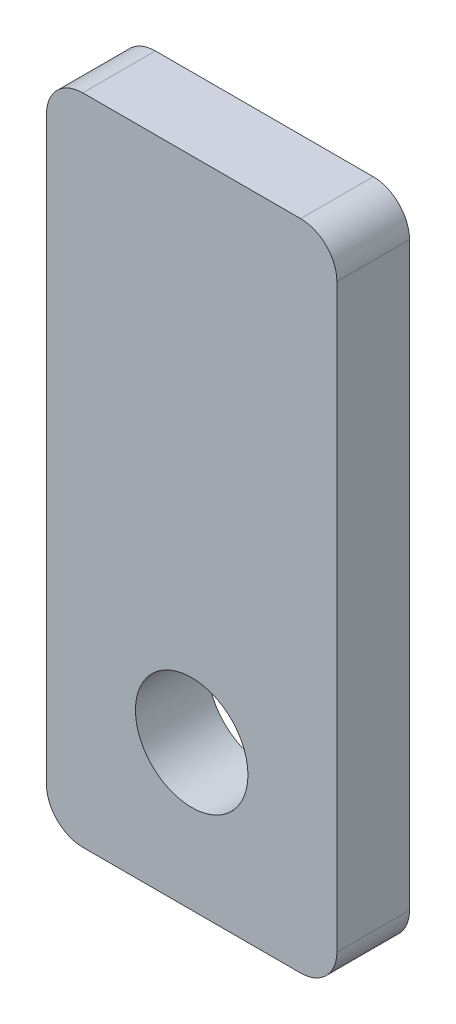
ISO-10303-21;
HEADER;
FILE_DESCRIPTION(('STEP AP214'),'2;1');
FILE_NAME('part.step','',(''),(''),'','','');
FILE_SCHEMA(('AUTOMOTIVE_DESIGN { 1 0 10303 214 1 1 1 1 }'));
ENDSEC;
DATA;
#1=APPLICATION_CONTEXT('core data for automotive mechanical design processes');
#2=APPLICATION_PROTOCOL_DEFINITION('international standard','automotive_design',2000,#1);
#3=PRODUCT_CONTEXT('',#1,'mechanical');
#4=PRODUCT('Part','Part','',(#3));
#5=PRODUCT_RELATED_PRODUCT_CATEGORY('part','',(#4));
#6=PRODUCT_DEFINITION_FORMATION('','',#4);
#7=PRODUCT_DEFINITION_CONTEXT('part definition',#1,'design');
#8=PRODUCT_DEFINITION('design','',#6,#7);
#9=PRODUCT_DEFINITION_SHAPE('','',#8);
#10=(LENGTH_UNIT() NAMED_UNIT(*) SI_UNIT(.MILLI.,.METRE.));
#11=(NAMED_UNIT(*) PLANE_ANGLE_UNIT() SI_UNIT($,.RADIAN.));
#12=(NAMED_UNIT(*) SI_UNIT($,.STERADIAN.) SOLID_ANGLE_UNIT());
#13=UNCERTAINTY_MEASURE_WITH_UNIT(LENGTH_MEASURE(1.E-05),#10,'distance_accuracy_value','');
#14=(GEOMETRIC_REPRESENTATION_CONTEXT(3) GLOBAL_UNCERTAINTY_ASSIGNED_CONTEXT((#13)) GLOBAL_UNIT_ASSIGNED_CONTEXT((#10,
#11,#12)) REPRESENTATION_CONTEXT('',''));
#15=CARTESIAN_POINT('',(0.,0.,0.));
#16=DIRECTION('',(0.,0.,1.));
#17=DIRECTION('',(1.,0.,0.));
#18=AXIS2_PLACEMENT_3D('',#15,#16,#17);
#19=CARTESIAN_POINT('',(-3.,-8.,2.));
#20=DIRECTION('',(0.,0.,1.));
#21=DIRECTION('',(1.,0.,0.));
#22=AXIS2_PLACEMENT_3D('',#19,#20,#21);
#23=PLANE('',#22);
#24=CARTESIAN_POINT('',(-3.,-8.,2.));
#25=DIRECTION('',(0.,0.,1.));
#26=DIRECTION('',(1.,0.,0.));
#27=AXIS2_PLACEMENT_3D('',#24,#25,#26);
#28=CIRCLE('',#27,1.);
#29=CARTESIAN_POINT('',(-4.,-7.99999999999999,2.));
#30=VERTEX_POINT('',#29);
#31=CARTESIAN_POINT('',(-2.99999999999999,-9.,2.));
#32=VERTEX_POINT('',#31);
#33=EDGE_CURVE('E168',#30,#32,#28,.T.);
#34=ORIENTED_EDGE('',*,*,#33,.T.);
#35=DIRECTION('',(1.,0.,0.));
#36=VECTOR('',#35,1.);
#37=CARTESIAN_POINT('',(-2.99999999999999,-9.,2.));
#38=LINE('',#37,#36);
#39=CARTESIAN_POINT('',(3.,-9.,2.));
#40=VERTEX_POINT('',#39);
#41=EDGE_CURVE('E104',#32,#40,#38,.T.);
#42=ORIENTED_EDGE('',*,*,#41,.T.);
#43=CARTESIAN_POINT('',(3.,-8.,2.));
#44=DIRECTION('',(0.,0.,1.));
#45=DIRECTION('',(1.,0.,0.));
#46=AXIS2_PLACEMENT_3D('',#43,#44,#45);
#47=CIRCLE('',#46,1.);
#48=CARTESIAN_POINT('',(4.,-7.99999999999999,2.));
#49=VERTEX_POINT('',#48);
#50=EDGE_CURVE('E189',#40,#49,#47,.T.);
#51=ORIENTED_EDGE('',*,*,#50,.T.);
#52=DIRECTION('',(0.,1.,0.));
#53=VECTOR('',#52,1.);
#54=CARTESIAN_POINT('',(4.,7.99999999999999,2.));
#55=LINE('',#54,#53);
#56=CARTESIAN_POINT('',(4.,7.99999999999999,2.));
#57=VERTEX_POINT('',#56);
#58=EDGE_CURVE('E203',#49,#57,#55,.T.);
#59=ORIENTED_EDGE('',*,*,#58,.T.);
#60=CARTESIAN_POINT('',(3.,8.,2.));
#61=DIRECTION('',(0.,0.,1.));
#62=DIRECTION('',(1.,0.,0.));
#63=AXIS2_PLACEMENT_3D('',#60,#61,#62);
#64=CIRCLE('',#63,1.);
#65=CARTESIAN_POINT('',(2.99999999999999,9.,2.));
#66=VERTEX_POINT('',#65);
#67=EDGE_CURVE('E123',#57,#66,#64,.T.);
#68=ORIENTED_EDGE('',*,*,#67,.T.);
#69=DIRECTION('',(-1.,0.,0.));
#70=VECTOR('',#69,1.);
#71=CARTESIAN_POINT('',(-2.99999999999999,9.,2.));
#72=LINE('',#71,#70);
#73=CARTESIAN_POINT('',(-2.99999999999999,9.,2.));
#74=VERTEX_POINT('',#73);
#75=EDGE_CURVE('E117',#66,#74,#72,.T.);
#76=ORIENTED_EDGE('',*,*,#75,.T.);
#77=CARTESIAN_POINT('',(-3.,8.,2.));
#78=DIRECTION('',(0.,0.,1.));
#79=DIRECTION('',(1.,0.,0.));
#80=AXIS2_PLACEMENT_3D('',#77,#78,#79);
#81=CIRCLE('',#80,1.);
#82=CARTESIAN_POINT('',(-4.,7.99999999999999,2.));
#83=VERTEX_POINT('',#82);
#84=EDGE_CURVE('E121',#74,#83,#81,.T.);
#85=ORIENTED_EDGE('',*,*,#84,.T.);
#86=DIRECTION('',(0.,-1.,0.));
#87=VECTOR('',#86,1.);
#88=CARTESIAN_POINT('',(-4.,7.99999999999999,2.));
#89=LINE('',#88,#87);
#90=EDGE_CURVE('E61',#83,#30,#89,.T.);
#91=ORIENTED_EDGE('',*,*,#90,.T.);
#92=EDGE_LOOP('',(#34,#42,#51,#59,#68,#76,#85,#91));
#93=FACE_BOUND('',#92,.T.);
#94=CARTESIAN_POINT('',(0.,-5.,2.));
#95=DIRECTION('',(0.,0.,1.));
#96=DIRECTION('',(1.,0.,0.));
#97=AXIS2_PLACEMENT_3D('',#94,#95,#96);
#98=CIRCLE('',#97,1.55);
#99=CARTESIAN_POINT('',(1.55,-5.,2.));
#100=VERTEX_POINT('',#99);
#101=EDGE_CURVE('E150',#100,#100,#98,.T.);
#102=ORIENTED_EDGE('',*,*,#101,.F.);
#103=EDGE_LOOP('',(#102));
#104=FACE_BOUND('',#103,.T.);
#105=ADVANCED_FACE('F43',(#93,#104),#23,.T.);
#106=CARTESIAN_POINT('',(-3.,-8.,0.));
#107=DIRECTION('',(0.,0.,1.));
#108=DIRECTION('',(1.,0.,0.));
#109=AXIS2_PLACEMENT_3D('',#106,#107,#108);
#110=PLANE('',#109);
#111=CARTESIAN_POINT('',(-3.,-8.,0.));
#112=DIRECTION('',(0.,0.,1.));
#113=DIRECTION('',(1.,0.,0.));
#114=AXIS2_PLACEMENT_3D('',#111,#112,#113);
#115=CIRCLE('',#114,1.);
#116=CARTESIAN_POINT('',(-4.,-7.99999999999999,0.));
#117=VERTEX_POINT('',#116);
#118=CARTESIAN_POINT('',(-2.99999999999999,-9.,0.));
#119=VERTEX_POINT('',#118);
#120=EDGE_CURVE('E145',#117,#119,#115,.T.);
#121=ORIENTED_EDGE('',*,*,#120,.F.);
#122=DIRECTION('',(0.,-1.,0.));
#123=VECTOR('',#122,1.);
#124=CARTESIAN_POINT('',(-4.,7.99999999999999,0.));
#125=LINE('',#124,#123);
#126=CARTESIAN_POINT('',(-4.,7.99999999999999,0.));
#127=VERTEX_POINT('',#126);
#128=EDGE_CURVE('E96',#127,#117,#125,.T.);
#129=ORIENTED_EDGE('',*,*,#128,.F.);
#130=CARTESIAN_POINT('',(-3.,8.,0.));
#131=DIRECTION('',(0.,0.,1.));
#132=DIRECTION('',(1.,0.,0.));
#133=AXIS2_PLACEMENT_3D('',#130,#131,#132);
#134=CIRCLE('',#133,1.);
#135=CARTESIAN_POINT('',(-2.99999999999999,9.,0.));
#136=VERTEX_POINT('',#135);
#137=EDGE_CURVE('E90',#136,#127,#134,.T.);
#138=ORIENTED_EDGE('',*,*,#137,.F.);
#139=DIRECTION('',(-1.,0.,0.));
#140=VECTOR('',#139,1.);
#141=CARTESIAN_POINT('',(-2.99999999999999,9.,0.));
#142=LINE('',#141,#140);
#143=CARTESIAN_POINT('',(2.99999999999999,9.,0.));
#144=VERTEX_POINT('',#143);
#145=EDGE_CURVE('E132',#144,#136,#142,.T.);
#146=ORIENTED_EDGE('',*,*,#145,.F.);
#147=CARTESIAN_POINT('',(3.,8.,0.));
#148=DIRECTION('',(0.,0.,1.));
#149=DIRECTION('',(1.,0.,0.));
#150=AXIS2_PLACEMENT_3D('',#147,#148,#149);
#151=CIRCLE('',#150,1.);
#152=CARTESIAN_POINT('',(4.,7.99999999999999,0.));
#153=VERTEX_POINT('',#152);
#154=EDGE_CURVE('E159',#153,#144,#151,.T.);
#155=ORIENTED_EDGE('',*,*,#154,.F.);
#156=DIRECTION('',(0.,1.,0.));
#157=VECTOR('',#156,1.);
#158=CARTESIAN_POINT('',(4.,7.99999999999999,0.));
#159=LINE('',#158,#157);
#160=CARTESIAN_POINT('',(4.,-7.99999999999999,0.));
#161=VERTEX_POINT('',#160);
#162=EDGE_CURVE('E156',#161,#153,#159,.T.);
#163=ORIENTED_EDGE('',*,*,#162,.F.);
#164=CARTESIAN_POINT('',(3.,-8.,0.));
#165=DIRECTION('',(0.,0.,1.));
#166=DIRECTION('',(1.,0.,0.));
#167=AXIS2_PLACEMENT_3D('',#164,#165,#166);
#168=CIRCLE('',#167,1.);
#169=CARTESIAN_POINT('',(3.,-9.,0.));
#170=VERTEX_POINT('',#169);
#171=EDGE_CURVE('E153',#170,#161,#168,.T.);
#172=ORIENTED_EDGE('',*,*,#171,.F.);
#173=DIRECTION('',(1.,0.,0.));
#174=VECTOR('',#173,1.);
#175=CARTESIAN_POINT('',(-2.99999999999999,-9.,0.));
#176=LINE('',#175,#174);
#177=EDGE_CURVE('E149',#119,#170,#176,.T.);
#178=ORIENTED_EDGE('',*,*,#177,.F.);
#179=EDGE_LOOP('',(#121,#129,#138,#146,#155,#163,#172,#178));
#180=FACE_BOUND('',#179,.T.);
#181=CARTESIAN_POINT('',(0.,-5.,0.));
#182=DIRECTION('',(0.,0.,1.));
#183=DIRECTION('',(1.,0.,0.));
#184=AXIS2_PLACEMENT_3D('',#181,#182,#183);
#185=CIRCLE('',#184,1.55);
#186=CARTESIAN_POINT('',(1.55,-5.,0.));
#187=VERTEX_POINT('',#186);
#188=EDGE_CURVE('E213',#187,#187,#185,.T.);
#189=ORIENTED_EDGE('',*,*,#188,.T.);
#190=EDGE_LOOP('',(#189));
#191=FACE_BOUND('',#190,.T.);
#192=ADVANCED_FACE('F193',(#180,#191),#110,.F.);
#193=CARTESIAN_POINT('',(-3.,-8.,2.));
#194=DIRECTION('',(0.,0.,-1.));
#195=DIRECTION('',(-1.,0.,0.));
#196=AXIS2_PLACEMENT_3D('',#193,#194,#195);
#197=CYLINDRICAL_SURFACE('',#196,1.);
#198=ORIENTED_EDGE('',*,*,#120,.T.);
#199=DIRECTION('',(0.,0.,-1.));
#200=VECTOR('',#199,1.);
#201=CARTESIAN_POINT('',(-2.99999999999999,-9.,2.));
#202=LINE('',#201,#200);
#203=EDGE_CURVE('E11',#32,#119,#202,.T.);
#204=ORIENTED_EDGE('',*,*,#203,.F.);
#205=ORIENTED_EDGE('',*,*,#33,.F.);
#206=DIRECTION('',(0.,0.,-1.));
#207=VECTOR('',#206,1.);
#208=CARTESIAN_POINT('',(-4.,-7.99999999999999,2.));
#209=LINE('',#208,#207);
#210=EDGE_CURVE('E141',#30,#117,#209,.T.);
#211=ORIENTED_EDGE('',*,*,#210,.T.);
#212=EDGE_LOOP('',(#198,#204,#205,#211));
#213=FACE_BOUND('',#212,.T.);
#214=ADVANCED_FACE('F45',(#213),#197,.T.);
#215=CARTESIAN_POINT('',(-2.99999999999999,-9.,2.));
#216=DIRECTION('',(0.,1.,0.));
#217=DIRECTION('',(0.,0.,1.));
#218=AXIS2_PLACEMENT_3D('',#215,#216,#217);
#219=PLANE('',#218);
#220=ORIENTED_EDGE('',*,*,#177,.T.);
#221=DIRECTION('',(0.,0.,-1.));
#222=VECTOR('',#221,1.);
#223=CARTESIAN_POINT('',(3.,-9.,2.));
#224=LINE('',#223,#222);
#225=EDGE_CURVE('E53',#40,#170,#224,.T.);
#226=ORIENTED_EDGE('',*,*,#225,.F.);
#227=ORIENTED_EDGE('',*,*,#41,.F.);
#228=ORIENTED_EDGE('',*,*,#203,.T.);
#229=EDGE_LOOP('',(#220,#226,#227,#228));
#230=FACE_BOUND('',#229,.T.);
#231=ADVANCED_FACE('F243',(#230),#219,.F.);
#232=CARTESIAN_POINT('',(3.,-8.,2.));
#233=DIRECTION('',(0.,0.,-1.));
#234=DIRECTION('',(-1.,0.,0.));
#235=AXIS2_PLACEMENT_3D('',#232,#233,#234);
#236=CYLINDRICAL_SURFACE('',#235,1.);
#237=ORIENTED_EDGE('',*,*,#171,.T.);
#238=DIRECTION('',(0.,0.,-1.));
#239=VECTOR('',#238,1.);
#240=CARTESIAN_POINT('',(4.,-7.99999999999999,2.));
#241=LINE('',#240,#239);
#242=EDGE_CURVE('E179',#49,#161,#241,.T.);
#243=ORIENTED_EDGE('',*,*,#242,.F.);
#244=ORIENTED_EDGE('',*,*,#50,.F.);
#245=ORIENTED_EDGE('',*,*,#225,.T.);
#246=EDGE_LOOP('',(#237,#243,#244,#245));
#247=FACE_BOUND('',#246,.T.);
#248=ADVANCED_FACE('F187',(#247),#236,.T.);
#249=CARTESIAN_POINT('',(4.,7.99999999999999,2.));
#250=DIRECTION('',(-1.,0.,0.));
#251=DIRECTION('',(0.,-1.,0.));
#252=AXIS2_PLACEMENT_3D('',#249,#250,#251);
#253=PLANE('',#252);
#254=ORIENTED_EDGE('',*,*,#162,.T.);
#255=DIRECTION('',(0.,0.,-1.));
#256=VECTOR('',#255,1.);
#257=CARTESIAN_POINT('',(4.,7.99999999999999,2.));
#258=LINE('',#257,#256);
#259=EDGE_CURVE('E175',#57,#153,#258,.T.);
#260=ORIENTED_EDGE('',*,*,#259,.F.);
#261=ORIENTED_EDGE('',*,*,#58,.F.);
#262=ORIENTED_EDGE('',*,*,#242,.T.);
#263=EDGE_LOOP('',(#254,#260,#261,#262));
#264=FACE_BOUND('',#263,.T.);
#265=ADVANCED_FACE('F198',(#264),#253,.F.);
#266=CARTESIAN_POINT('',(3.,8.,2.));
#267=DIRECTION('',(0.,0.,-1.));
#268=DIRECTION('',(-1.,0.,0.));
#269=AXIS2_PLACEMENT_3D('',#266,#267,#268);
#270=CYLINDRICAL_SURFACE('',#269,1.);
#271=ORIENTED_EDGE('',*,*,#154,.T.);
#272=DIRECTION('',(0.,0.,-1.));
#273=VECTOR('',#272,1.);
#274=CARTESIAN_POINT('',(2.99999999999999,9.,2.));
#275=LINE('',#274,#273);
#276=EDGE_CURVE('E134',#66,#144,#275,.T.);
#277=ORIENTED_EDGE('',*,*,#276,.F.);
#278=ORIENTED_EDGE('',*,*,#67,.F.);
#279=ORIENTED_EDGE('',*,*,#259,.T.);
#280=EDGE_LOOP('',(#271,#277,#278,#279));
#281=FACE_BOUND('',#280,.T.);
#282=ADVANCED_FACE('F201',(#281),#270,.T.);
#283=CARTESIAN_POINT('',(-2.99999999999999,9.,2.));
#284=DIRECTION('',(0.,-1.,0.));
#285=DIRECTION('',(0.,0.,-1.));
#286=AXIS2_PLACEMENT_3D('',#283,#284,#285);
#287=PLANE('',#286);
#288=ORIENTED_EDGE('',*,*,#145,.T.);
#289=DIRECTION('',(0.,0.,-1.));
#290=VECTOR('',#289,1.);
#291=CARTESIAN_POINT('',(-2.99999999999999,9.,2.));
#292=LINE('',#291,#290);
#293=EDGE_CURVE('E129',#74,#136,#292,.T.);
#294=ORIENTED_EDGE('',*,*,#293,.F.);
#295=ORIENTED_EDGE('',*,*,#75,.F.);
#296=ORIENTED_EDGE('',*,*,#276,.T.);
#297=EDGE_LOOP('',(#288,#294,#295,#296));
#298=FACE_BOUND('',#297,.T.);
#299=ADVANCED_FACE('F130',(#298),#287,.F.);
#300=CARTESIAN_POINT('',(-3.,8.,2.));
#301=DIRECTION('',(0.,0.,-1.));
#302=DIRECTION('',(-1.,0.,0.));
#303=AXIS2_PLACEMENT_3D('',#300,#301,#302);
#304=CYLINDRICAL_SURFACE('',#303,1.);
#305=ORIENTED_EDGE('',*,*,#137,.T.);
#306=DIRECTION('',(0.,0.,-1.));
#307=VECTOR('',#306,1.);
#308=CARTESIAN_POINT('',(-4.,7.99999999999999,2.));
#309=LINE('',#308,#307);
#310=EDGE_CURVE('E135',#83,#127,#309,.T.);
#311=ORIENTED_EDGE('',*,*,#310,.F.);
#312=ORIENTED_EDGE('',*,*,#84,.F.);
#313=ORIENTED_EDGE('',*,*,#293,.T.);
#314=EDGE_LOOP('',(#305,#311,#312,#313));
#315=FACE_BOUND('',#314,.T.);
#316=ADVANCED_FACE('F137',(#315),#304,.T.);
#317=CARTESIAN_POINT('',(-4.,7.99999999999999,2.));
#318=DIRECTION('',(1.,0.,0.));
#319=DIRECTION('',(0.,1.,0.));
#320=AXIS2_PLACEMENT_3D('',#317,#318,#319);
#321=PLANE('',#320);
#322=ORIENTED_EDGE('',*,*,#128,.T.);
#323=ORIENTED_EDGE('',*,*,#210,.F.);
#324=ORIENTED_EDGE('',*,*,#90,.F.);
#325=ORIENTED_EDGE('',*,*,#310,.T.);
#326=EDGE_LOOP('',(#322,#323,#324,#325));
#327=FACE_BOUND('',#326,.T.);
#328=ADVANCED_FACE('F231',(#327),#321,.F.);
#329=CARTESIAN_POINT('',(0.,-5.,2.));
#330=DIRECTION('',(0.,0.,-1.));
#331=DIRECTION('',(-1.,0.,0.));
#332=AXIS2_PLACEMENT_3D('',#329,#330,#331);
#333=CYLINDRICAL_SURFACE('',#332,1.55);
#334=ORIENTED_EDGE('',*,*,#101,.T.);
#335=EDGE_LOOP('',(#334));
#336=FACE_BOUND('',#335,.T.);
#337=ORIENTED_EDGE('',*,*,#188,.F.);
#338=EDGE_LOOP('',(#337));
#339=FACE_BOUND('',#338,.T.);
#340=ADVANCED_FACE('F221',(#336,#339),#333,.F.);
#341=CLOSED_SHELL('',(#105,#192,#214,#231,#248,#265,#282,#299,#316,#328,#340));
#342=MANIFOLD_SOLID_BREP('B2',#341);
#343=ADVANCED_BREP_SHAPE_REPRESENTATION('',(#18,#342),#14);
#344=SHAPE_DEFINITION_REPRESENTATION(#9,#343);
ENDSEC;
END-ISO-10303-21;
